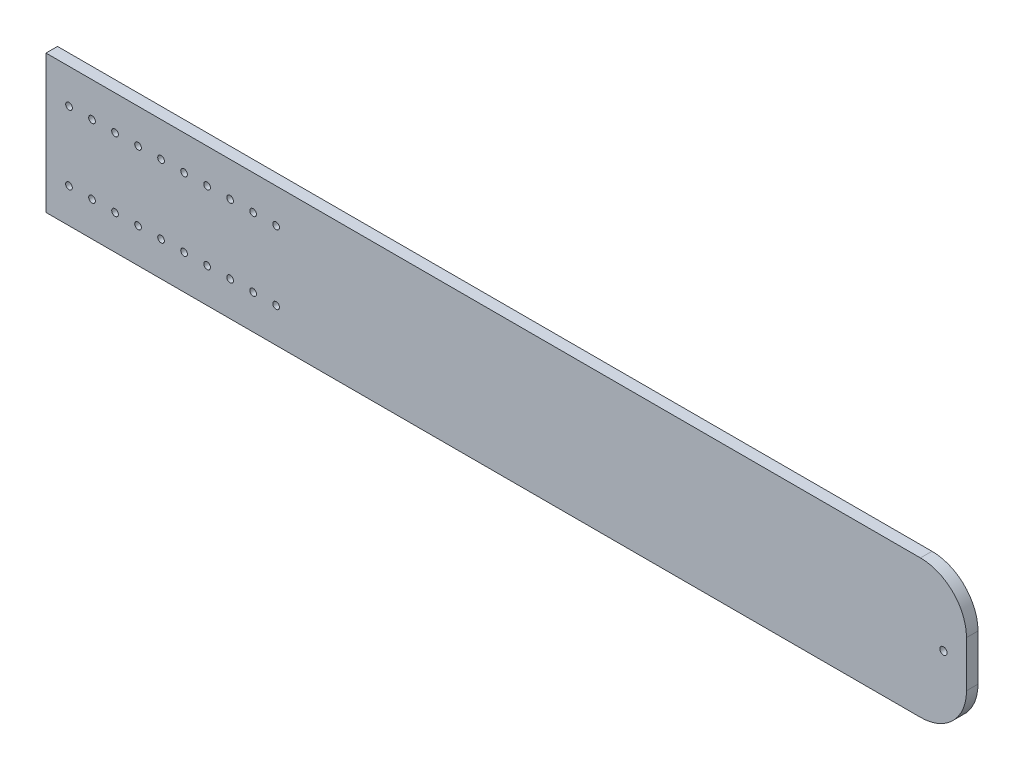
ISO-10303-21;
HEADER;
FILE_DESCRIPTION(('STEP AP214'),'2;1');
FILE_NAME('part.step','',(''),(''),'','','');
FILE_SCHEMA(('AUTOMOTIVE_DESIGN { 1 0 10303 214 1 1 1 1 }'));
ENDSEC;
DATA;
#1=APPLICATION_CONTEXT('core data for automotive mechanical design processes');
#2=APPLICATION_PROTOCOL_DEFINITION('international standard','automotive_design',2000,#1);
#3=PRODUCT_CONTEXT('',#1,'mechanical');
#4=PRODUCT('Part','Part','',(#3));
#5=PRODUCT_RELATED_PRODUCT_CATEGORY('part','',(#4));
#6=PRODUCT_DEFINITION_FORMATION('','',#4);
#7=PRODUCT_DEFINITION_CONTEXT('part definition',#1,'design');
#8=PRODUCT_DEFINITION('design','',#6,#7);
#9=PRODUCT_DEFINITION_SHAPE('','',#8);
#10=(LENGTH_UNIT() NAMED_UNIT(*) SI_UNIT(.MILLI.,.METRE.));
#11=(NAMED_UNIT(*) PLANE_ANGLE_UNIT() SI_UNIT($,.RADIAN.));
#12=(NAMED_UNIT(*) SI_UNIT($,.STERADIAN.) SOLID_ANGLE_UNIT());
#13=UNCERTAINTY_MEASURE_WITH_UNIT(LENGTH_MEASURE(1.E-05),#10,'distance_accuracy_value','');
#14=(GEOMETRIC_REPRESENTATION_CONTEXT(3) GLOBAL_UNCERTAINTY_ASSIGNED_CONTEXT((#13)) GLOBAL_UNIT_ASSIGNED_CONTEXT((#10,
#11,#12)) REPRESENTATION_CONTEXT('',''));
#15=CARTESIAN_POINT('',(0.,0.,0.));
#16=DIRECTION('',(0.,0.,1.));
#17=DIRECTION('',(1.,0.,0.));
#18=AXIS2_PLACEMENT_3D('',#15,#16,#17);
#19=CARTESIAN_POINT('',(0.,0.,6.35));
#20=DIRECTION('',(1.,0.,0.));
#21=DIRECTION('',(0.,0.,-1.));
#22=AXIS2_PLACEMENT_3D('',#19,#20,#21);
#23=PLANE('',#22);
#24=DIRECTION('',(0.,-1.,0.));
#25=VECTOR('',#24,1.);
#26=CARTESIAN_POINT('',(0.,0.,0.));
#27=LINE('',#26,#25);
#28=CARTESIAN_POINT('',(0.,76.2,0.));
#29=VERTEX_POINT('',#28);
#30=CARTESIAN_POINT('',(0.,0.,0.));
#31=VERTEX_POINT('',#30);
#32=EDGE_CURVE('E105',#29,#31,#27,.T.);
#33=ORIENTED_EDGE('',*,*,#32,.T.);
#34=DIRECTION('',(0.,0.,-1.));
#35=VECTOR('',#34,1.);
#36=CARTESIAN_POINT('',(0.,0.,6.35));
#37=LINE('',#36,#35);
#38=CARTESIAN_POINT('',(0.,0.,6.35));
#39=VERTEX_POINT('',#38);
#40=EDGE_CURVE('E90',#39,#31,#37,.T.);
#41=ORIENTED_EDGE('',*,*,#40,.F.);
#42=DIRECTION('',(0.,-1.,0.));
#43=VECTOR('',#42,1.);
#44=CARTESIAN_POINT('',(0.,0.,6.35));
#45=LINE('',#44,#43);
#46=CARTESIAN_POINT('',(0.,76.2,6.35));
#47=VERTEX_POINT('',#46);
#48=EDGE_CURVE('E94',#47,#39,#45,.T.);
#49=ORIENTED_EDGE('',*,*,#48,.F.);
#50=DIRECTION('',(0.,0.,-1.));
#51=VECTOR('',#50,1.);
#52=CARTESIAN_POINT('',(0.,76.2,6.35));
#53=LINE('',#52,#51);
#54=EDGE_CURVE('E107',#47,#29,#53,.T.);
#55=ORIENTED_EDGE('',*,*,#54,.T.);
#56=EDGE_LOOP('',(#33,#41,#49,#55));
#57=FACE_BOUND('',#56,.T.);
#58=ADVANCED_FACE('F33',(#57),#23,.F.);
#59=CARTESIAN_POINT('',(0.,0.,6.35));
#60=DIRECTION('',(0.,1.,0.));
#61=DIRECTION('',(0.,0.,1.));
#62=AXIS2_PLACEMENT_3D('',#59,#60,#61);
#63=PLANE('',#62);
#64=DIRECTION('',(1.,0.,0.));
#65=VECTOR('',#64,1.);
#66=CARTESIAN_POINT('',(0.,0.,0.));
#67=LINE('',#66,#65);
#68=CARTESIAN_POINT('',(482.6,0.,0.));
#69=VERTEX_POINT('',#68);
#70=EDGE_CURVE('E133',#31,#69,#67,.T.);
#71=ORIENTED_EDGE('',*,*,#70,.T.);
#72=DIRECTION('',(0.,0.,-1.));
#73=VECTOR('',#72,1.);
#74=CARTESIAN_POINT('',(482.6,0.,6.35));
#75=LINE('',#74,#73);
#76=CARTESIAN_POINT('',(482.6,0.,6.35));
#77=VERTEX_POINT('',#76);
#78=EDGE_CURVE('E56',#69,#77,#75,.F.);
#79=ORIENTED_EDGE('',*,*,#78,.T.);
#80=DIRECTION('',(1.,0.,0.));
#81=VECTOR('',#80,1.);
#82=CARTESIAN_POINT('',(0.,0.,6.35));
#83=LINE('',#82,#81);
#84=EDGE_CURVE('E86',#39,#77,#83,.T.);
#85=ORIENTED_EDGE('',*,*,#84,.F.);
#86=ORIENTED_EDGE('',*,*,#40,.T.);
#87=EDGE_LOOP('',(#71,#79,#85,#86));
#88=FACE_BOUND('',#87,.T.);
#89=ADVANCED_FACE('F88',(#88),#63,.F.);
#90=CARTESIAN_POINT('',(508.,0.,6.35));
#91=DIRECTION('',(-1.,0.,0.));
#92=DIRECTION('',(0.,0.,1.));
#93=AXIS2_PLACEMENT_3D('',#90,#91,#92);
#94=PLANE('',#93);
#95=DIRECTION('',(0.,1.,0.));
#96=VECTOR('',#95,1.);
#97=CARTESIAN_POINT('',(508.,0.,6.35));
#98=LINE('',#97,#96);
#99=CARTESIAN_POINT('',(508.,25.4,6.35));
#100=VERTEX_POINT('',#99);
#101=CARTESIAN_POINT('',(508.,50.8,6.35));
#102=VERTEX_POINT('',#101);
#103=EDGE_CURVE('E93',#100,#102,#98,.T.);
#104=ORIENTED_EDGE('',*,*,#103,.F.);
#105=DIRECTION('',(0.,0.,-1.));
#106=VECTOR('',#105,1.);
#107=CARTESIAN_POINT('',(508.,25.4,6.35));
#108=LINE('',#107,#106);
#109=CARTESIAN_POINT('',(508.,25.4,0.));
#110=VERTEX_POINT('',#109);
#111=EDGE_CURVE('E109',#100,#110,#108,.T.);
#112=ORIENTED_EDGE('',*,*,#111,.T.);
#113=DIRECTION('',(0.,1.,0.));
#114=VECTOR('',#113,1.);
#115=CARTESIAN_POINT('',(508.,0.,0.));
#116=LINE('',#115,#114);
#117=CARTESIAN_POINT('',(508.,50.8,0.));
#118=VERTEX_POINT('',#117);
#119=EDGE_CURVE('E134',#110,#118,#116,.T.);
#120=ORIENTED_EDGE('',*,*,#119,.T.);
#121=DIRECTION('',(0.,0.,-1.));
#122=VECTOR('',#121,1.);
#123=CARTESIAN_POINT('',(508.,50.8,6.35));
#124=LINE('',#123,#122);
#125=EDGE_CURVE('E106',#118,#102,#124,.F.);
#126=ORIENTED_EDGE('',*,*,#125,.T.);
#127=EDGE_LOOP('',(#104,#112,#120,#126));
#128=FACE_BOUND('',#127,.T.);
#129=ADVANCED_FACE('F125',(#128),#94,.F.);
#130=CARTESIAN_POINT('',(0.,76.2,6.35));
#131=DIRECTION('',(0.,-1.,0.));
#132=DIRECTION('',(0.,0.,-1.));
#133=AXIS2_PLACEMENT_3D('',#130,#131,#132);
#134=PLANE('',#133);
#135=DIRECTION('',(-1.,0.,0.));
#136=VECTOR('',#135,1.);
#137=CARTESIAN_POINT('',(0.,76.2,6.35));
#138=LINE('',#137,#136);
#139=CARTESIAN_POINT('',(482.6,76.2,6.35));
#140=VERTEX_POINT('',#139);
#141=EDGE_CURVE('E98',#140,#47,#138,.T.);
#142=ORIENTED_EDGE('',*,*,#141,.F.);
#143=DIRECTION('',(0.,0.,-1.));
#144=VECTOR('',#143,1.);
#145=CARTESIAN_POINT('',(482.6,76.2,6.35));
#146=LINE('',#145,#144);
#147=CARTESIAN_POINT('',(482.6,76.2,0.));
#148=VERTEX_POINT('',#147);
#149=EDGE_CURVE('E11',#140,#148,#146,.T.);
#150=ORIENTED_EDGE('',*,*,#149,.T.);
#151=DIRECTION('',(-1.,0.,0.));
#152=VECTOR('',#151,1.);
#153=CARTESIAN_POINT('',(0.,76.2,0.));
#154=LINE('',#153,#152);
#155=EDGE_CURVE('E102',#148,#29,#154,.T.);
#156=ORIENTED_EDGE('',*,*,#155,.T.);
#157=ORIENTED_EDGE('',*,*,#54,.F.);
#158=EDGE_LOOP('',(#142,#150,#156,#157));
#159=FACE_BOUND('',#158,.T.);
#160=ADVANCED_FACE('F142',(#159),#134,.F.);
#161=CARTESIAN_POINT('',(0.,76.2,6.35));
#162=DIRECTION('',(0.,0.,-1.));
#163=DIRECTION('',(-1.,0.,0.));
#164=AXIS2_PLACEMENT_3D('',#161,#162,#163);
#165=PLANE('',#164);
#166=CARTESIAN_POINT('',(495.3,38.1,6.35));
#167=DIRECTION('',(0.,0.,1.));
#168=DIRECTION('',(1.,0.,0.));
#169=AXIS2_PLACEMENT_3D('',#166,#167,#168);
#170=CIRCLE('',#169,2.00660000000001);
#171=CARTESIAN_POINT('',(497.3066,38.1,6.35));
#172=VERTEX_POINT('',#171);
#173=EDGE_CURVE('E264',#172,#172,#170,.T.);
#174=ORIENTED_EDGE('',*,*,#173,.F.);
#175=EDGE_LOOP('',(#174));
#176=FACE_BOUND('',#175,.T.);
#177=CARTESIAN_POINT('',(127.,19.05,6.35));
#178=DIRECTION('',(0.,0.,1.));
#179=DIRECTION('',(1.,0.,0.));
#180=AXIS2_PLACEMENT_3D('',#177,#178,#179);
#181=CIRCLE('',#180,1.84150000000001);
#182=CARTESIAN_POINT('',(128.8415,19.05,6.35));
#183=VERTEX_POINT('',#182);
#184=EDGE_CURVE('E257',#183,#183,#181,.T.);
#185=ORIENTED_EDGE('',*,*,#184,.F.);
#186=EDGE_LOOP('',(#185));
#187=FACE_BOUND('',#186,.T.);
#188=CARTESIAN_POINT('',(114.3,19.05,6.35));
#189=DIRECTION('',(0.,0.,1.));
#190=DIRECTION('',(1.,0.,0.));
#191=AXIS2_PLACEMENT_3D('',#188,#189,#190);
#192=CIRCLE('',#191,1.8415);
#193=CARTESIAN_POINT('',(116.1415,19.05,6.35));
#194=VERTEX_POINT('',#193);
#195=EDGE_CURVE('E261',#194,#194,#192,.T.);
#196=ORIENTED_EDGE('',*,*,#195,.F.);
#197=EDGE_LOOP('',(#196));
#198=FACE_BOUND('',#197,.T.);
#199=CARTESIAN_POINT('',(101.6,19.05,6.35));
#200=DIRECTION('',(0.,0.,1.));
#201=DIRECTION('',(1.,0.,0.));
#202=AXIS2_PLACEMENT_3D('',#199,#200,#201);
#203=CIRCLE('',#202,1.8415);
#204=CARTESIAN_POINT('',(103.4415,19.05,6.35));
#205=VERTEX_POINT('',#204);
#206=EDGE_CURVE('E271',#205,#205,#203,.T.);
#207=ORIENTED_EDGE('',*,*,#206,.F.);
#208=EDGE_LOOP('',(#207));
#209=FACE_BOUND('',#208,.T.);
#210=CARTESIAN_POINT('',(88.9000000000004,19.05,6.35));
#211=DIRECTION('',(0.,0.,1.));
#212=DIRECTION('',(1.,0.,0.));
#213=AXIS2_PLACEMENT_3D('',#210,#211,#212);
#214=CIRCLE('',#213,1.8415);
#215=CARTESIAN_POINT('',(90.7415000000004,19.05,6.35));
#216=VERTEX_POINT('',#215);
#217=EDGE_CURVE('E277',#216,#216,#214,.T.);
#218=ORIENTED_EDGE('',*,*,#217,.F.);
#219=EDGE_LOOP('',(#218));
#220=FACE_BOUND('',#219,.T.);
#221=CARTESIAN_POINT('',(76.2000000000004,19.05,6.35));
#222=DIRECTION('',(0.,0.,1.));
#223=DIRECTION('',(1.,0.,0.));
#224=AXIS2_PLACEMENT_3D('',#221,#222,#223);
#225=CIRCLE('',#224,1.8415);
#226=CARTESIAN_POINT('',(78.0415000000004,19.05,6.35));
#227=VERTEX_POINT('',#226);
#228=EDGE_CURVE('E283',#227,#227,#225,.T.);
#229=ORIENTED_EDGE('',*,*,#228,.F.);
#230=EDGE_LOOP('',(#229));
#231=FACE_BOUND('',#230,.T.);
#232=CARTESIAN_POINT('',(63.5000000000004,19.05,6.35));
#233=DIRECTION('',(0.,0.,1.));
#234=DIRECTION('',(1.,0.,0.));
#235=AXIS2_PLACEMENT_3D('',#232,#233,#234);
#236=CIRCLE('',#235,1.8415);
#237=CARTESIAN_POINT('',(65.3415000000004,19.05,6.35));
#238=VERTEX_POINT('',#237);
#239=EDGE_CURVE('E289',#238,#238,#236,.T.);
#240=ORIENTED_EDGE('',*,*,#239,.F.);
#241=EDGE_LOOP('',(#240));
#242=FACE_BOUND('',#241,.T.);
#243=CARTESIAN_POINT('',(50.8000000000004,19.05,6.35));
#244=DIRECTION('',(0.,0.,1.));
#245=DIRECTION('',(1.,0.,0.));
#246=AXIS2_PLACEMENT_3D('',#243,#244,#245);
#247=CIRCLE('',#246,1.8415);
#248=CARTESIAN_POINT('',(52.6415000000004,19.05,6.35));
#249=VERTEX_POINT('',#248);
#250=EDGE_CURVE('E295',#249,#249,#247,.T.);
#251=ORIENTED_EDGE('',*,*,#250,.F.);
#252=EDGE_LOOP('',(#251));
#253=FACE_BOUND('',#252,.T.);
#254=CARTESIAN_POINT('',(38.1000000000004,19.05,6.35));
#255=DIRECTION('',(0.,0.,1.));
#256=DIRECTION('',(1.,0.,0.));
#257=AXIS2_PLACEMENT_3D('',#254,#255,#256);
#258=CIRCLE('',#257,1.8415);
#259=CARTESIAN_POINT('',(39.9415000000004,19.05,6.35));
#260=VERTEX_POINT('',#259);
#261=EDGE_CURVE('E301',#260,#260,#258,.T.);
#262=ORIENTED_EDGE('',*,*,#261,.F.);
#263=EDGE_LOOP('',(#262));
#264=FACE_BOUND('',#263,.T.);
#265=CARTESIAN_POINT('',(25.4000000000004,19.05,6.35));
#266=DIRECTION('',(0.,0.,1.));
#267=DIRECTION('',(1.,0.,0.));
#268=AXIS2_PLACEMENT_3D('',#265,#266,#267);
#269=CIRCLE('',#268,1.8415);
#270=CARTESIAN_POINT('',(27.2415000000004,19.05,6.35));
#271=VERTEX_POINT('',#270);
#272=EDGE_CURVE('E307',#271,#271,#269,.T.);
#273=ORIENTED_EDGE('',*,*,#272,.F.);
#274=EDGE_LOOP('',(#273));
#275=FACE_BOUND('',#274,.T.);
#276=CARTESIAN_POINT('',(12.7000000000004,19.05,6.35));
#277=DIRECTION('',(0.,0.,1.));
#278=DIRECTION('',(1.,0.,0.));
#279=AXIS2_PLACEMENT_3D('',#276,#277,#278);
#280=CIRCLE('',#279,1.8415);
#281=CARTESIAN_POINT('',(14.5415000000004,19.05,6.35));
#282=VERTEX_POINT('',#281);
#283=EDGE_CURVE('E313',#282,#282,#280,.T.);
#284=ORIENTED_EDGE('',*,*,#283,.F.);
#285=EDGE_LOOP('',(#284));
#286=FACE_BOUND('',#285,.T.);
#287=CARTESIAN_POINT('',(127.,57.15,6.35));
#288=DIRECTION('',(0.,0.,1.));
#289=DIRECTION('',(1.,0.,0.));
#290=AXIS2_PLACEMENT_3D('',#287,#288,#289);
#291=CIRCLE('',#290,1.84149999999999);
#292=CARTESIAN_POINT('',(128.8415,57.15,6.35));
#293=VERTEX_POINT('',#292);
#294=EDGE_CURVE('E319',#293,#293,#291,.T.);
#295=ORIENTED_EDGE('',*,*,#294,.F.);
#296=EDGE_LOOP('',(#295));
#297=FACE_BOUND('',#296,.T.);
#298=CARTESIAN_POINT('',(114.3,57.15,6.35));
#299=DIRECTION('',(0.,0.,1.));
#300=DIRECTION('',(1.,0.,0.));
#301=AXIS2_PLACEMENT_3D('',#298,#299,#300);
#302=CIRCLE('',#301,1.8415);
#303=CARTESIAN_POINT('',(116.1415,57.15,6.35));
#304=VERTEX_POINT('',#303);
#305=EDGE_CURVE('E325',#304,#304,#302,.T.);
#306=ORIENTED_EDGE('',*,*,#305,.F.);
#307=EDGE_LOOP('',(#306));
#308=FACE_BOUND('',#307,.T.);
#309=CARTESIAN_POINT('',(101.6,57.15,6.35));
#310=DIRECTION('',(0.,0.,1.));
#311=DIRECTION('',(1.,0.,0.));
#312=AXIS2_PLACEMENT_3D('',#309,#310,#311);
#313=CIRCLE('',#312,1.8415);
#314=CARTESIAN_POINT('',(103.4415,57.15,6.35));
#315=VERTEX_POINT('',#314);
#316=EDGE_CURVE('E331',#315,#315,#313,.T.);
#317=ORIENTED_EDGE('',*,*,#316,.F.);
#318=EDGE_LOOP('',(#317));
#319=FACE_BOUND('',#318,.T.);
#320=CARTESIAN_POINT('',(88.9,57.15,6.35));
#321=DIRECTION('',(0.,0.,1.));
#322=DIRECTION('',(1.,0.,0.));
#323=AXIS2_PLACEMENT_3D('',#320,#321,#322);
#324=CIRCLE('',#323,1.8415);
#325=CARTESIAN_POINT('',(90.7415,57.15,6.35));
#326=VERTEX_POINT('',#325);
#327=EDGE_CURVE('E337',#326,#326,#324,.T.);
#328=ORIENTED_EDGE('',*,*,#327,.F.);
#329=EDGE_LOOP('',(#328));
#330=FACE_BOUND('',#329,.T.);
#331=CARTESIAN_POINT('',(76.2,57.15,6.35));
#332=DIRECTION('',(0.,0.,1.));
#333=DIRECTION('',(1.,0.,0.));
#334=AXIS2_PLACEMENT_3D('',#331,#332,#333);
#335=CIRCLE('',#334,1.8415);
#336=CARTESIAN_POINT('',(78.0415,57.15,6.35));
#337=VERTEX_POINT('',#336);
#338=EDGE_CURVE('E343',#337,#337,#335,.T.);
#339=ORIENTED_EDGE('',*,*,#338,.F.);
#340=EDGE_LOOP('',(#339));
#341=FACE_BOUND('',#340,.T.);
#342=CARTESIAN_POINT('',(63.5,57.15,6.35));
#343=DIRECTION('',(0.,0.,1.));
#344=DIRECTION('',(1.,0.,0.));
#345=AXIS2_PLACEMENT_3D('',#342,#343,#344);
#346=CIRCLE('',#345,1.8415);
#347=CARTESIAN_POINT('',(65.3415,57.15,6.35));
#348=VERTEX_POINT('',#347);
#349=EDGE_CURVE('E349',#348,#348,#346,.T.);
#350=ORIENTED_EDGE('',*,*,#349,.F.);
#351=EDGE_LOOP('',(#350));
#352=FACE_BOUND('',#351,.T.);
#353=CARTESIAN_POINT('',(50.8,57.15,6.35));
#354=DIRECTION('',(0.,0.,1.));
#355=DIRECTION('',(1.,0.,0.));
#356=AXIS2_PLACEMENT_3D('',#353,#354,#355);
#357=CIRCLE('',#356,1.8415);
#358=CARTESIAN_POINT('',(52.6415,57.15,6.35));
#359=VERTEX_POINT('',#358);
#360=EDGE_CURVE('E355',#359,#359,#357,.T.);
#361=ORIENTED_EDGE('',*,*,#360,.F.);
#362=EDGE_LOOP('',(#361));
#363=FACE_BOUND('',#362,.T.);
#364=CARTESIAN_POINT('',(38.1,57.15,6.35));
#365=DIRECTION('',(0.,0.,1.));
#366=DIRECTION('',(1.,0.,0.));
#367=AXIS2_PLACEMENT_3D('',#364,#365,#366);
#368=CIRCLE('',#367,1.8415);
#369=CARTESIAN_POINT('',(39.9415,57.15,6.35));
#370=VERTEX_POINT('',#369);
#371=EDGE_CURVE('E361',#370,#370,#368,.T.);
#372=ORIENTED_EDGE('',*,*,#371,.F.);
#373=EDGE_LOOP('',(#372));
#374=FACE_BOUND('',#373,.T.);
#375=CARTESIAN_POINT('',(25.4,57.15,6.35));
#376=DIRECTION('',(0.,0.,1.));
#377=DIRECTION('',(1.,0.,0.));
#378=AXIS2_PLACEMENT_3D('',#375,#376,#377);
#379=CIRCLE('',#378,1.8415);
#380=CARTESIAN_POINT('',(27.2415,57.15,6.35));
#381=VERTEX_POINT('',#380);
#382=EDGE_CURVE('E367',#381,#381,#379,.T.);
#383=ORIENTED_EDGE('',*,*,#382,.F.);
#384=EDGE_LOOP('',(#383));
#385=FACE_BOUND('',#384,.T.);
#386=CARTESIAN_POINT('',(12.7,57.15,6.35));
#387=DIRECTION('',(0.,0.,1.));
#388=DIRECTION('',(1.,0.,0.));
#389=AXIS2_PLACEMENT_3D('',#386,#387,#388);
#390=CIRCLE('',#389,1.8415);
#391=CARTESIAN_POINT('',(14.5415,57.15,6.35));
#392=VERTEX_POINT('',#391);
#393=EDGE_CURVE('E373',#392,#392,#390,.T.);
#394=ORIENTED_EDGE('',*,*,#393,.F.);
#395=EDGE_LOOP('',(#394));
#396=FACE_BOUND('',#395,.T.);
#397=ORIENTED_EDGE('',*,*,#84,.T.);
#398=CARTESIAN_POINT('',(482.6,25.4,6.35));
#399=DIRECTION('',(0.,0.,-1.));
#400=DIRECTION('',(-1.,0.,0.));
#401=AXIS2_PLACEMENT_3D('',#398,#399,#400);
#402=CIRCLE('',#401,25.4);
#403=EDGE_CURVE('E41',#77,#100,#402,.F.);
#404=ORIENTED_EDGE('',*,*,#403,.T.);
#405=ORIENTED_EDGE('',*,*,#103,.T.);
#406=CARTESIAN_POINT('',(482.6,50.8,6.35));
#407=DIRECTION('',(0.,0.,-1.));
#408=DIRECTION('',(-1.,0.,0.));
#409=AXIS2_PLACEMENT_3D('',#406,#407,#408);
#410=CIRCLE('',#409,25.4);
#411=EDGE_CURVE('E48',#102,#140,#410,.F.);
#412=ORIENTED_EDGE('',*,*,#411,.T.);
#413=ORIENTED_EDGE('',*,*,#141,.T.);
#414=ORIENTED_EDGE('',*,*,#48,.T.);
#415=EDGE_LOOP('',(#397,#404,#405,#412,#413,#414));
#416=FACE_BOUND('',#415,.T.);
#417=ADVANCED_FACE('F97',(#176,#187,#198,#209,#220,#231,#242,#253,#264,#275,#286,#297,#308,#319,
#330,#341,#352,#363,#374,#385,#396,#416),#165,.F.);
#418=CARTESIAN_POINT('',(0.,76.2,0.));
#419=DIRECTION('',(0.,0.,-1.));
#420=DIRECTION('',(-1.,0.,0.));
#421=AXIS2_PLACEMENT_3D('',#418,#419,#420);
#422=PLANE('',#421);
#423=CARTESIAN_POINT('',(495.3,38.1,0.));
#424=DIRECTION('',(0.,0.,1.));
#425=DIRECTION('',(1.,0.,0.));
#426=AXIS2_PLACEMENT_3D('',#423,#424,#425);
#427=CIRCLE('',#426,2.00660000000001);
#428=CARTESIAN_POINT('',(497.3066,38.1,0.));
#429=VERTEX_POINT('',#428);
#430=EDGE_CURVE('E259',#429,#429,#427,.T.);
#431=ORIENTED_EDGE('',*,*,#430,.T.);
#432=EDGE_LOOP('',(#431));
#433=FACE_BOUND('',#432,.T.);
#434=CARTESIAN_POINT('',(127.,19.05,0.));
#435=DIRECTION('',(0.,0.,1.));
#436=DIRECTION('',(1.,0.,0.));
#437=AXIS2_PLACEMENT_3D('',#434,#435,#436);
#438=CIRCLE('',#437,1.84150000000001);
#439=CARTESIAN_POINT('',(128.8415,19.05,0.));
#440=VERTEX_POINT('',#439);
#441=EDGE_CURVE('E254',#440,#440,#438,.T.);
#442=ORIENTED_EDGE('',*,*,#441,.T.);
#443=EDGE_LOOP('',(#442));
#444=FACE_BOUND('',#443,.T.);
#445=CARTESIAN_POINT('',(114.3,19.05,0.));
#446=DIRECTION('',(0.,0.,1.));
#447=DIRECTION('',(1.,0.,0.));
#448=AXIS2_PLACEMENT_3D('',#445,#446,#447);
#449=CIRCLE('',#448,1.8415);
#450=CARTESIAN_POINT('',(116.1415,19.05,0.));
#451=VERTEX_POINT('',#450);
#452=EDGE_CURVE('E268',#451,#451,#449,.T.);
#453=ORIENTED_EDGE('',*,*,#452,.T.);
#454=EDGE_LOOP('',(#453));
#455=FACE_BOUND('',#454,.T.);
#456=CARTESIAN_POINT('',(101.6,19.05,0.));
#457=DIRECTION('',(0.,0.,1.));
#458=DIRECTION('',(1.,0.,0.));
#459=AXIS2_PLACEMENT_3D('',#456,#457,#458);
#460=CIRCLE('',#459,1.8415);
#461=CARTESIAN_POINT('',(103.4415,19.05,0.));
#462=VERTEX_POINT('',#461);
#463=EDGE_CURVE('E274',#462,#462,#460,.T.);
#464=ORIENTED_EDGE('',*,*,#463,.T.);
#465=EDGE_LOOP('',(#464));
#466=FACE_BOUND('',#465,.T.);
#467=CARTESIAN_POINT('',(88.9000000000004,19.05,0.));
#468=DIRECTION('',(0.,0.,1.));
#469=DIRECTION('',(1.,0.,0.));
#470=AXIS2_PLACEMENT_3D('',#467,#468,#469);
#471=CIRCLE('',#470,1.8415);
#472=CARTESIAN_POINT('',(90.7415000000004,19.05,0.));
#473=VERTEX_POINT('',#472);
#474=EDGE_CURVE('E280',#473,#473,#471,.T.);
#475=ORIENTED_EDGE('',*,*,#474,.T.);
#476=EDGE_LOOP('',(#475));
#477=FACE_BOUND('',#476,.T.);
#478=CARTESIAN_POINT('',(76.2000000000004,19.05,0.));
#479=DIRECTION('',(0.,0.,1.));
#480=DIRECTION('',(1.,0.,0.));
#481=AXIS2_PLACEMENT_3D('',#478,#479,#480);
#482=CIRCLE('',#481,1.8415);
#483=CARTESIAN_POINT('',(78.0415000000004,19.05,0.));
#484=VERTEX_POINT('',#483);
#485=EDGE_CURVE('E286',#484,#484,#482,.T.);
#486=ORIENTED_EDGE('',*,*,#485,.T.);
#487=EDGE_LOOP('',(#486));
#488=FACE_BOUND('',#487,.T.);
#489=CARTESIAN_POINT('',(63.5000000000004,19.05,0.));
#490=DIRECTION('',(0.,0.,1.));
#491=DIRECTION('',(1.,0.,0.));
#492=AXIS2_PLACEMENT_3D('',#489,#490,#491);
#493=CIRCLE('',#492,1.8415);
#494=CARTESIAN_POINT('',(65.3415000000004,19.05,0.));
#495=VERTEX_POINT('',#494);
#496=EDGE_CURVE('E292',#495,#495,#493,.T.);
#497=ORIENTED_EDGE('',*,*,#496,.T.);
#498=EDGE_LOOP('',(#497));
#499=FACE_BOUND('',#498,.T.);
#500=CARTESIAN_POINT('',(50.8000000000004,19.05,0.));
#501=DIRECTION('',(0.,0.,1.));
#502=DIRECTION('',(1.,0.,0.));
#503=AXIS2_PLACEMENT_3D('',#500,#501,#502);
#504=CIRCLE('',#503,1.8415);
#505=CARTESIAN_POINT('',(52.6415000000004,19.05,0.));
#506=VERTEX_POINT('',#505);
#507=EDGE_CURVE('E298',#506,#506,#504,.T.);
#508=ORIENTED_EDGE('',*,*,#507,.T.);
#509=EDGE_LOOP('',(#508));
#510=FACE_BOUND('',#509,.T.);
#511=CARTESIAN_POINT('',(38.1000000000004,19.05,0.));
#512=DIRECTION('',(0.,0.,1.));
#513=DIRECTION('',(1.,0.,0.));
#514=AXIS2_PLACEMENT_3D('',#511,#512,#513);
#515=CIRCLE('',#514,1.8415);
#516=CARTESIAN_POINT('',(39.9415000000004,19.05,0.));
#517=VERTEX_POINT('',#516);
#518=EDGE_CURVE('E304',#517,#517,#515,.T.);
#519=ORIENTED_EDGE('',*,*,#518,.T.);
#520=EDGE_LOOP('',(#519));
#521=FACE_BOUND('',#520,.T.);
#522=CARTESIAN_POINT('',(25.4000000000004,19.05,0.));
#523=DIRECTION('',(0.,0.,1.));
#524=DIRECTION('',(1.,0.,0.));
#525=AXIS2_PLACEMENT_3D('',#522,#523,#524);
#526=CIRCLE('',#525,1.8415);
#527=CARTESIAN_POINT('',(27.2415000000004,19.05,0.));
#528=VERTEX_POINT('',#527);
#529=EDGE_CURVE('E310',#528,#528,#526,.T.);
#530=ORIENTED_EDGE('',*,*,#529,.T.);
#531=EDGE_LOOP('',(#530));
#532=FACE_BOUND('',#531,.T.);
#533=CARTESIAN_POINT('',(12.7000000000004,19.05,0.));
#534=DIRECTION('',(0.,0.,1.));
#535=DIRECTION('',(1.,0.,0.));
#536=AXIS2_PLACEMENT_3D('',#533,#534,#535);
#537=CIRCLE('',#536,1.8415);
#538=CARTESIAN_POINT('',(14.5415000000004,19.05,0.));
#539=VERTEX_POINT('',#538);
#540=EDGE_CURVE('E316',#539,#539,#537,.T.);
#541=ORIENTED_EDGE('',*,*,#540,.T.);
#542=EDGE_LOOP('',(#541));
#543=FACE_BOUND('',#542,.T.);
#544=CARTESIAN_POINT('',(127.,57.15,0.));
#545=DIRECTION('',(0.,0.,1.));
#546=DIRECTION('',(1.,0.,0.));
#547=AXIS2_PLACEMENT_3D('',#544,#545,#546);
#548=CIRCLE('',#547,1.84149999999999);
#549=CARTESIAN_POINT('',(128.8415,57.15,0.));
#550=VERTEX_POINT('',#549);
#551=EDGE_CURVE('E322',#550,#550,#548,.T.);
#552=ORIENTED_EDGE('',*,*,#551,.T.);
#553=EDGE_LOOP('',(#552));
#554=FACE_BOUND('',#553,.T.);
#555=CARTESIAN_POINT('',(114.3,57.15,0.));
#556=DIRECTION('',(0.,0.,1.));
#557=DIRECTION('',(1.,0.,0.));
#558=AXIS2_PLACEMENT_3D('',#555,#556,#557);
#559=CIRCLE('',#558,1.8415);
#560=CARTESIAN_POINT('',(116.1415,57.15,0.));
#561=VERTEX_POINT('',#560);
#562=EDGE_CURVE('E328',#561,#561,#559,.T.);
#563=ORIENTED_EDGE('',*,*,#562,.T.);
#564=EDGE_LOOP('',(#563));
#565=FACE_BOUND('',#564,.T.);
#566=CARTESIAN_POINT('',(101.6,57.15,0.));
#567=DIRECTION('',(0.,0.,1.));
#568=DIRECTION('',(1.,0.,0.));
#569=AXIS2_PLACEMENT_3D('',#566,#567,#568);
#570=CIRCLE('',#569,1.8415);
#571=CARTESIAN_POINT('',(103.4415,57.15,0.));
#572=VERTEX_POINT('',#571);
#573=EDGE_CURVE('E334',#572,#572,#570,.T.);
#574=ORIENTED_EDGE('',*,*,#573,.T.);
#575=EDGE_LOOP('',(#574));
#576=FACE_BOUND('',#575,.T.);
#577=CARTESIAN_POINT('',(88.9,57.15,0.));
#578=DIRECTION('',(0.,0.,1.));
#579=DIRECTION('',(1.,0.,0.));
#580=AXIS2_PLACEMENT_3D('',#577,#578,#579);
#581=CIRCLE('',#580,1.8415);
#582=CARTESIAN_POINT('',(90.7415,57.15,0.));
#583=VERTEX_POINT('',#582);
#584=EDGE_CURVE('E340',#583,#583,#581,.T.);
#585=ORIENTED_EDGE('',*,*,#584,.T.);
#586=EDGE_LOOP('',(#585));
#587=FACE_BOUND('',#586,.T.);
#588=CARTESIAN_POINT('',(76.2,57.15,0.));
#589=DIRECTION('',(0.,0.,1.));
#590=DIRECTION('',(1.,0.,0.));
#591=AXIS2_PLACEMENT_3D('',#588,#589,#590);
#592=CIRCLE('',#591,1.8415);
#593=CARTESIAN_POINT('',(78.0415,57.15,0.));
#594=VERTEX_POINT('',#593);
#595=EDGE_CURVE('E346',#594,#594,#592,.T.);
#596=ORIENTED_EDGE('',*,*,#595,.T.);
#597=EDGE_LOOP('',(#596));
#598=FACE_BOUND('',#597,.T.);
#599=CARTESIAN_POINT('',(63.5,57.15,0.));
#600=DIRECTION('',(0.,0.,1.));
#601=DIRECTION('',(1.,0.,0.));
#602=AXIS2_PLACEMENT_3D('',#599,#600,#601);
#603=CIRCLE('',#602,1.8415);
#604=CARTESIAN_POINT('',(65.3415,57.15,0.));
#605=VERTEX_POINT('',#604);
#606=EDGE_CURVE('E352',#605,#605,#603,.T.);
#607=ORIENTED_EDGE('',*,*,#606,.T.);
#608=EDGE_LOOP('',(#607));
#609=FACE_BOUND('',#608,.T.);
#610=CARTESIAN_POINT('',(50.8,57.15,0.));
#611=DIRECTION('',(0.,0.,1.));
#612=DIRECTION('',(1.,0.,0.));
#613=AXIS2_PLACEMENT_3D('',#610,#611,#612);
#614=CIRCLE('',#613,1.8415);
#615=CARTESIAN_POINT('',(52.6415,57.15,0.));
#616=VERTEX_POINT('',#615);
#617=EDGE_CURVE('E358',#616,#616,#614,.T.);
#618=ORIENTED_EDGE('',*,*,#617,.T.);
#619=EDGE_LOOP('',(#618));
#620=FACE_BOUND('',#619,.T.);
#621=CARTESIAN_POINT('',(38.1,57.15,0.));
#622=DIRECTION('',(0.,0.,1.));
#623=DIRECTION('',(1.,0.,0.));
#624=AXIS2_PLACEMENT_3D('',#621,#622,#623);
#625=CIRCLE('',#624,1.8415);
#626=CARTESIAN_POINT('',(39.9415,57.15,0.));
#627=VERTEX_POINT('',#626);
#628=EDGE_CURVE('E364',#627,#627,#625,.T.);
#629=ORIENTED_EDGE('',*,*,#628,.T.);
#630=EDGE_LOOP('',(#629));
#631=FACE_BOUND('',#630,.T.);
#632=CARTESIAN_POINT('',(25.4,57.15,0.));
#633=DIRECTION('',(0.,0.,1.));
#634=DIRECTION('',(1.,0.,0.));
#635=AXIS2_PLACEMENT_3D('',#632,#633,#634);
#636=CIRCLE('',#635,1.8415);
#637=CARTESIAN_POINT('',(27.2415,57.15,0.));
#638=VERTEX_POINT('',#637);
#639=EDGE_CURVE('E370',#638,#638,#636,.T.);
#640=ORIENTED_EDGE('',*,*,#639,.T.);
#641=EDGE_LOOP('',(#640));
#642=FACE_BOUND('',#641,.T.);
#643=CARTESIAN_POINT('',(12.7,57.15,0.));
#644=DIRECTION('',(0.,0.,1.));
#645=DIRECTION('',(1.,0.,0.));
#646=AXIS2_PLACEMENT_3D('',#643,#644,#645);
#647=CIRCLE('',#646,1.8415);
#648=CARTESIAN_POINT('',(14.5415,57.15,0.));
#649=VERTEX_POINT('',#648);
#650=EDGE_CURVE('E137',#649,#649,#647,.T.);
#651=ORIENTED_EDGE('',*,*,#650,.T.);
#652=EDGE_LOOP('',(#651));
#653=FACE_BOUND('',#652,.T.);
#654=ORIENTED_EDGE('',*,*,#119,.F.);
#655=CARTESIAN_POINT('',(482.6,25.4,0.));
#656=DIRECTION('',(0.,0.,-1.));
#657=DIRECTION('',(-1.,0.,0.));
#658=AXIS2_PLACEMENT_3D('',#655,#656,#657);
#659=CIRCLE('',#658,25.4);
#660=EDGE_CURVE('E118',#110,#69,#659,.T.);
#661=ORIENTED_EDGE('',*,*,#660,.T.);
#662=ORIENTED_EDGE('',*,*,#70,.F.);
#663=ORIENTED_EDGE('',*,*,#32,.F.);
#664=ORIENTED_EDGE('',*,*,#155,.F.);
#665=CARTESIAN_POINT('',(482.6,50.8,0.));
#666=DIRECTION('',(0.,0.,-1.));
#667=DIRECTION('',(-1.,0.,0.));
#668=AXIS2_PLACEMENT_3D('',#665,#666,#667);
#669=CIRCLE('',#668,25.4);
#670=EDGE_CURVE('E116',#148,#118,#669,.T.);
#671=ORIENTED_EDGE('',*,*,#670,.T.);
#672=EDGE_LOOP('',(#654,#661,#662,#663,#664,#671));
#673=FACE_BOUND('',#672,.T.);
#674=ADVANCED_FACE('F132',(#433,#444,#455,#466,#477,#488,#499,#510,#521,#532,#543,#554,#565,
#576,#587,#598,#609,#620,#631,#642,#653,#673),#422,.T.);
#675=CARTESIAN_POINT('',(12.7,57.15,0.));
#676=DIRECTION('',(0.,0.,1.));
#677=DIRECTION('',(1.,0.,0.));
#678=AXIS2_PLACEMENT_3D('',#675,#676,#677);
#679=CYLINDRICAL_SURFACE('',#678,1.8415);
#680=ORIENTED_EDGE('',*,*,#650,.F.);
#681=EDGE_LOOP('',(#680));
#682=FACE_BOUND('',#681,.T.);
#683=ORIENTED_EDGE('',*,*,#393,.T.);
#684=EDGE_LOOP('',(#683));
#685=FACE_BOUND('',#684,.T.);
#686=ADVANCED_FACE('F167',(#682,#685),#679,.F.);
#687=CARTESIAN_POINT('',(25.4,57.15,0.));
#688=DIRECTION('',(0.,0.,1.));
#689=DIRECTION('',(1.,0.,0.));
#690=AXIS2_PLACEMENT_3D('',#687,#688,#689);
#691=CYLINDRICAL_SURFACE('',#690,1.8415);
#692=ORIENTED_EDGE('',*,*,#639,.F.);
#693=EDGE_LOOP('',(#692));
#694=FACE_BOUND('',#693,.T.);
#695=ORIENTED_EDGE('',*,*,#382,.T.);
#696=EDGE_LOOP('',(#695));
#697=FACE_BOUND('',#696,.T.);
#698=ADVANCED_FACE('F174',(#694,#697),#691,.F.);
#699=CARTESIAN_POINT('',(38.1,57.15,0.));
#700=DIRECTION('',(0.,0.,1.));
#701=DIRECTION('',(1.,0.,0.));
#702=AXIS2_PLACEMENT_3D('',#699,#700,#701);
#703=CYLINDRICAL_SURFACE('',#702,1.8415);
#704=ORIENTED_EDGE('',*,*,#628,.F.);
#705=EDGE_LOOP('',(#704));
#706=FACE_BOUND('',#705,.T.);
#707=ORIENTED_EDGE('',*,*,#371,.T.);
#708=EDGE_LOOP('',(#707));
#709=FACE_BOUND('',#708,.T.);
#710=ADVANCED_FACE('F178',(#706,#709),#703,.F.);
#711=CARTESIAN_POINT('',(50.8,57.15,0.));
#712=DIRECTION('',(0.,0.,1.));
#713=DIRECTION('',(1.,0.,0.));
#714=AXIS2_PLACEMENT_3D('',#711,#712,#713);
#715=CYLINDRICAL_SURFACE('',#714,1.8415);
#716=ORIENTED_EDGE('',*,*,#617,.F.);
#717=EDGE_LOOP('',(#716));
#718=FACE_BOUND('',#717,.T.);
#719=ORIENTED_EDGE('',*,*,#360,.T.);
#720=EDGE_LOOP('',(#719));
#721=FACE_BOUND('',#720,.T.);
#722=ADVANCED_FACE('F182',(#718,#721),#715,.F.);
#723=CARTESIAN_POINT('',(63.5,57.15,0.));
#724=DIRECTION('',(0.,0.,1.));
#725=DIRECTION('',(1.,0.,0.));
#726=AXIS2_PLACEMENT_3D('',#723,#724,#725);
#727=CYLINDRICAL_SURFACE('',#726,1.8415);
#728=ORIENTED_EDGE('',*,*,#606,.F.);
#729=EDGE_LOOP('',(#728));
#730=FACE_BOUND('',#729,.T.);
#731=ORIENTED_EDGE('',*,*,#349,.T.);
#732=EDGE_LOOP('',(#731));
#733=FACE_BOUND('',#732,.T.);
#734=ADVANCED_FACE('F186',(#730,#733),#727,.F.);
#735=CARTESIAN_POINT('',(76.2,57.15,0.));
#736=DIRECTION('',(0.,0.,1.));
#737=DIRECTION('',(1.,0.,0.));
#738=AXIS2_PLACEMENT_3D('',#735,#736,#737);
#739=CYLINDRICAL_SURFACE('',#738,1.8415);
#740=ORIENTED_EDGE('',*,*,#595,.F.);
#741=EDGE_LOOP('',(#740));
#742=FACE_BOUND('',#741,.T.);
#743=ORIENTED_EDGE('',*,*,#338,.T.);
#744=EDGE_LOOP('',(#743));
#745=FACE_BOUND('',#744,.T.);
#746=ADVANCED_FACE('F190',(#742,#745),#739,.F.);
#747=CARTESIAN_POINT('',(88.9,57.15,0.));
#748=DIRECTION('',(0.,0.,1.));
#749=DIRECTION('',(1.,0.,0.));
#750=AXIS2_PLACEMENT_3D('',#747,#748,#749);
#751=CYLINDRICAL_SURFACE('',#750,1.8415);
#752=ORIENTED_EDGE('',*,*,#584,.F.);
#753=EDGE_LOOP('',(#752));
#754=FACE_BOUND('',#753,.T.);
#755=ORIENTED_EDGE('',*,*,#327,.T.);
#756=EDGE_LOOP('',(#755));
#757=FACE_BOUND('',#756,.T.);
#758=ADVANCED_FACE('F194',(#754,#757),#751,.F.);
#759=CARTESIAN_POINT('',(101.6,57.15,0.));
#760=DIRECTION('',(0.,0.,1.));
#761=DIRECTION('',(1.,0.,0.));
#762=AXIS2_PLACEMENT_3D('',#759,#760,#761);
#763=CYLINDRICAL_SURFACE('',#762,1.8415);
#764=ORIENTED_EDGE('',*,*,#573,.F.);
#765=EDGE_LOOP('',(#764));
#766=FACE_BOUND('',#765,.T.);
#767=ORIENTED_EDGE('',*,*,#316,.T.);
#768=EDGE_LOOP('',(#767));
#769=FACE_BOUND('',#768,.T.);
#770=ADVANCED_FACE('F198',(#766,#769),#763,.F.);
#771=CARTESIAN_POINT('',(114.3,57.15,0.));
#772=DIRECTION('',(0.,0.,1.));
#773=DIRECTION('',(1.,0.,0.));
#774=AXIS2_PLACEMENT_3D('',#771,#772,#773);
#775=CYLINDRICAL_SURFACE('',#774,1.8415);
#776=ORIENTED_EDGE('',*,*,#562,.F.);
#777=EDGE_LOOP('',(#776));
#778=FACE_BOUND('',#777,.T.);
#779=ORIENTED_EDGE('',*,*,#305,.T.);
#780=EDGE_LOOP('',(#779));
#781=FACE_BOUND('',#780,.T.);
#782=ADVANCED_FACE('F202',(#778,#781),#775,.F.);
#783=CARTESIAN_POINT('',(127.,57.15,0.));
#784=DIRECTION('',(0.,0.,1.));
#785=DIRECTION('',(1.,0.,0.));
#786=AXIS2_PLACEMENT_3D('',#783,#784,#785);
#787=CYLINDRICAL_SURFACE('',#786,1.84149999999999);
#788=ORIENTED_EDGE('',*,*,#551,.F.);
#789=EDGE_LOOP('',(#788));
#790=FACE_BOUND('',#789,.T.);
#791=ORIENTED_EDGE('',*,*,#294,.T.);
#792=EDGE_LOOP('',(#791));
#793=FACE_BOUND('',#792,.T.);
#794=ADVANCED_FACE('F206',(#790,#793),#787,.F.);
#795=CARTESIAN_POINT('',(12.7000000000004,19.05,0.));
#796=DIRECTION('',(0.,0.,1.));
#797=DIRECTION('',(1.,0.,0.));
#798=AXIS2_PLACEMENT_3D('',#795,#796,#797);
#799=CYLINDRICAL_SURFACE('',#798,1.8415);
#800=ORIENTED_EDGE('',*,*,#540,.F.);
#801=EDGE_LOOP('',(#800));
#802=FACE_BOUND('',#801,.T.);
#803=ORIENTED_EDGE('',*,*,#283,.T.);
#804=EDGE_LOOP('',(#803));
#805=FACE_BOUND('',#804,.T.);
#806=ADVANCED_FACE('F210',(#802,#805),#799,.F.);
#807=CARTESIAN_POINT('',(25.4000000000004,19.05,0.));
#808=DIRECTION('',(0.,0.,1.));
#809=DIRECTION('',(1.,0.,0.));
#810=AXIS2_PLACEMENT_3D('',#807,#808,#809);
#811=CYLINDRICAL_SURFACE('',#810,1.8415);
#812=ORIENTED_EDGE('',*,*,#529,.F.);
#813=EDGE_LOOP('',(#812));
#814=FACE_BOUND('',#813,.T.);
#815=ORIENTED_EDGE('',*,*,#272,.T.);
#816=EDGE_LOOP('',(#815));
#817=FACE_BOUND('',#816,.T.);
#818=ADVANCED_FACE('F214',(#814,#817),#811,.F.);
#819=CARTESIAN_POINT('',(38.1000000000004,19.05,0.));
#820=DIRECTION('',(0.,0.,1.));
#821=DIRECTION('',(1.,0.,0.));
#822=AXIS2_PLACEMENT_3D('',#819,#820,#821);
#823=CYLINDRICAL_SURFACE('',#822,1.8415);
#824=ORIENTED_EDGE('',*,*,#518,.F.);
#825=EDGE_LOOP('',(#824));
#826=FACE_BOUND('',#825,.T.);
#827=ORIENTED_EDGE('',*,*,#261,.T.);
#828=EDGE_LOOP('',(#827));
#829=FACE_BOUND('',#828,.T.);
#830=ADVANCED_FACE('F218',(#826,#829),#823,.F.);
#831=CARTESIAN_POINT('',(50.8000000000004,19.05,0.));
#832=DIRECTION('',(0.,0.,1.));
#833=DIRECTION('',(1.,0.,0.));
#834=AXIS2_PLACEMENT_3D('',#831,#832,#833);
#835=CYLINDRICAL_SURFACE('',#834,1.8415);
#836=ORIENTED_EDGE('',*,*,#507,.F.);
#837=EDGE_LOOP('',(#836));
#838=FACE_BOUND('',#837,.T.);
#839=ORIENTED_EDGE('',*,*,#250,.T.);
#840=EDGE_LOOP('',(#839));
#841=FACE_BOUND('',#840,.T.);
#842=ADVANCED_FACE('F222',(#838,#841),#835,.F.);
#843=CARTESIAN_POINT('',(63.5000000000004,19.05,0.));
#844=DIRECTION('',(0.,0.,1.));
#845=DIRECTION('',(1.,0.,0.));
#846=AXIS2_PLACEMENT_3D('',#843,#844,#845);
#847=CYLINDRICAL_SURFACE('',#846,1.8415);
#848=ORIENTED_EDGE('',*,*,#496,.F.);
#849=EDGE_LOOP('',(#848));
#850=FACE_BOUND('',#849,.T.);
#851=ORIENTED_EDGE('',*,*,#239,.T.);
#852=EDGE_LOOP('',(#851));
#853=FACE_BOUND('',#852,.T.);
#854=ADVANCED_FACE('F226',(#850,#853),#847,.F.);
#855=CARTESIAN_POINT('',(76.2000000000004,19.05,0.));
#856=DIRECTION('',(0.,0.,1.));
#857=DIRECTION('',(1.,0.,0.));
#858=AXIS2_PLACEMENT_3D('',#855,#856,#857);
#859=CYLINDRICAL_SURFACE('',#858,1.8415);
#860=ORIENTED_EDGE('',*,*,#485,.F.);
#861=EDGE_LOOP('',(#860));
#862=FACE_BOUND('',#861,.T.);
#863=ORIENTED_EDGE('',*,*,#228,.T.);
#864=EDGE_LOOP('',(#863));
#865=FACE_BOUND('',#864,.T.);
#866=ADVANCED_FACE('F230',(#862,#865),#859,.F.);
#867=CARTESIAN_POINT('',(88.9000000000004,19.05,0.));
#868=DIRECTION('',(0.,0.,1.));
#869=DIRECTION('',(1.,0.,0.));
#870=AXIS2_PLACEMENT_3D('',#867,#868,#869);
#871=CYLINDRICAL_SURFACE('',#870,1.8415);
#872=ORIENTED_EDGE('',*,*,#474,.F.);
#873=EDGE_LOOP('',(#872));
#874=FACE_BOUND('',#873,.T.);
#875=ORIENTED_EDGE('',*,*,#217,.T.);
#876=EDGE_LOOP('',(#875));
#877=FACE_BOUND('',#876,.T.);
#878=ADVANCED_FACE('F234',(#874,#877),#871,.F.);
#879=CARTESIAN_POINT('',(101.6,19.05,0.));
#880=DIRECTION('',(0.,0.,1.));
#881=DIRECTION('',(1.,0.,0.));
#882=AXIS2_PLACEMENT_3D('',#879,#880,#881);
#883=CYLINDRICAL_SURFACE('',#882,1.8415);
#884=ORIENTED_EDGE('',*,*,#463,.F.);
#885=EDGE_LOOP('',(#884));
#886=FACE_BOUND('',#885,.T.);
#887=ORIENTED_EDGE('',*,*,#206,.T.);
#888=EDGE_LOOP('',(#887));
#889=FACE_BOUND('',#888,.T.);
#890=ADVANCED_FACE('F238',(#886,#889),#883,.F.);
#891=CARTESIAN_POINT('',(114.3,19.05,0.));
#892=DIRECTION('',(0.,0.,1.));
#893=DIRECTION('',(1.,0.,0.));
#894=AXIS2_PLACEMENT_3D('',#891,#892,#893);
#895=CYLINDRICAL_SURFACE('',#894,1.8415);
#896=ORIENTED_EDGE('',*,*,#452,.F.);
#897=EDGE_LOOP('',(#896));
#898=FACE_BOUND('',#897,.T.);
#899=ORIENTED_EDGE('',*,*,#195,.T.);
#900=EDGE_LOOP('',(#899));
#901=FACE_BOUND('',#900,.T.);
#902=ADVANCED_FACE('F242',(#898,#901),#895,.F.);
#903=CARTESIAN_POINT('',(127.,19.05,0.));
#904=DIRECTION('',(0.,0.,1.));
#905=DIRECTION('',(1.,0.,0.));
#906=AXIS2_PLACEMENT_3D('',#903,#904,#905);
#907=CYLINDRICAL_SURFACE('',#906,1.84150000000001);
#908=ORIENTED_EDGE('',*,*,#441,.F.);
#909=EDGE_LOOP('',(#908));
#910=FACE_BOUND('',#909,.T.);
#911=ORIENTED_EDGE('',*,*,#184,.T.);
#912=EDGE_LOOP('',(#911));
#913=FACE_BOUND('',#912,.T.);
#914=ADVANCED_FACE('F153',(#910,#913),#907,.F.);
#915=CARTESIAN_POINT('',(482.6,25.4,6.35));
#916=DIRECTION('',(0.,0.,-1.));
#917=DIRECTION('',(-1.,0.,0.));
#918=AXIS2_PLACEMENT_3D('',#915,#916,#917);
#919=CYLINDRICAL_SURFACE('',#918,25.4);
#920=ORIENTED_EDGE('',*,*,#403,.F.);
#921=ORIENTED_EDGE('',*,*,#78,.F.);
#922=ORIENTED_EDGE('',*,*,#660,.F.);
#923=ORIENTED_EDGE('',*,*,#111,.F.);
#924=EDGE_LOOP('',(#920,#921,#922,#923));
#925=FACE_BOUND('',#924,.T.);
#926=ADVANCED_FACE('F130',(#925),#919,.T.);
#927=CARTESIAN_POINT('',(482.6,50.8,6.35));
#928=DIRECTION('',(0.,0.,-1.));
#929=DIRECTION('',(-1.,0.,0.));
#930=AXIS2_PLACEMENT_3D('',#927,#928,#929);
#931=CYLINDRICAL_SURFACE('',#930,25.4);
#932=ORIENTED_EDGE('',*,*,#411,.F.);
#933=ORIENTED_EDGE('',*,*,#125,.F.);
#934=ORIENTED_EDGE('',*,*,#670,.F.);
#935=ORIENTED_EDGE('',*,*,#149,.F.);
#936=EDGE_LOOP('',(#932,#933,#934,#935));
#937=FACE_BOUND('',#936,.T.);
#938=ADVANCED_FACE('F35',(#937),#931,.T.);
#939=CARTESIAN_POINT('',(495.3,38.1,0.));
#940=DIRECTION('',(0.,0.,1.));
#941=DIRECTION('',(1.,0.,0.));
#942=AXIS2_PLACEMENT_3D('',#939,#940,#941);
#943=CYLINDRICAL_SURFACE('',#942,2.00660000000001);
#944=ORIENTED_EDGE('',*,*,#430,.F.);
#945=EDGE_LOOP('',(#944));
#946=FACE_BOUND('',#945,.T.);
#947=ORIENTED_EDGE('',*,*,#173,.T.);
#948=EDGE_LOOP('',(#947));
#949=FACE_BOUND('',#948,.T.);
#950=ADVANCED_FACE('F146',(#946,#949),#943,.F.);
#951=CLOSED_SHELL('',(#58,#89,#129,#160,#417,#674,#686,#698,#710,#722,#734,#746,#758,#770,#782,
#794,#806,#818,#830,#842,#854,#866,#878,#890,#902,#914,#926,#938,#950));
#952=MANIFOLD_SOLID_BREP('B2',#951);
#953=ADVANCED_BREP_SHAPE_REPRESENTATION('',(#18,#952),#14);
#954=SHAPE_DEFINITION_REPRESENTATION(#9,#953);
ENDSEC;
END-ISO-10303-21;
